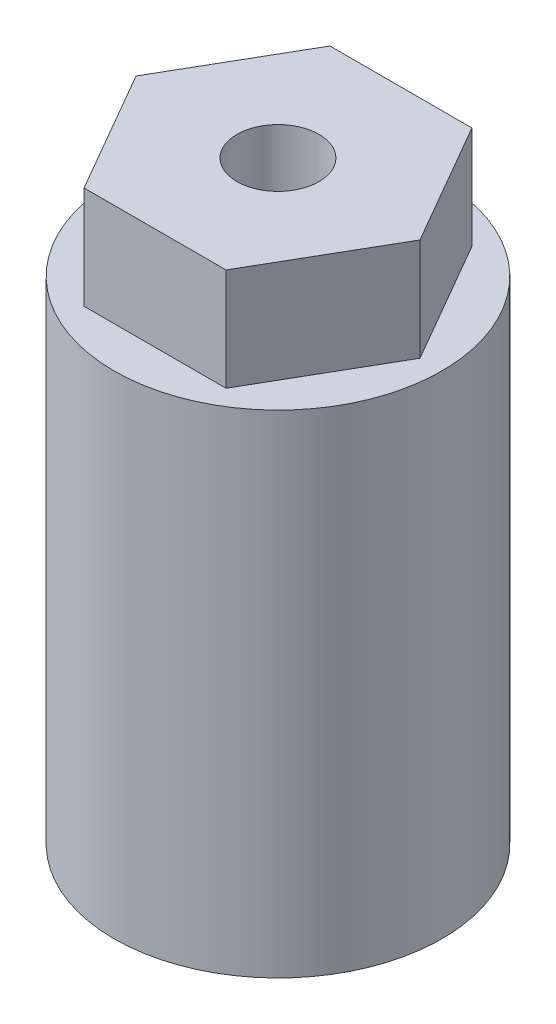
ISO-10303-21;
HEADER;
FILE_DESCRIPTION(('STEP AP214'),'2;1');
FILE_NAME('part.step','',(''),(''),'','','');
FILE_SCHEMA(('AUTOMOTIVE_DESIGN { 1 0 10303 214 1 1 1 1 }'));
ENDSEC;
DATA;
#1=APPLICATION_CONTEXT('core data for automotive mechanical design processes');
#2=APPLICATION_PROTOCOL_DEFINITION('international standard','automotive_design',2000,#1);
#3=PRODUCT_CONTEXT('',#1,'mechanical');
#4=PRODUCT('Part','Part','',(#3));
#5=PRODUCT_RELATED_PRODUCT_CATEGORY('part','',(#4));
#6=PRODUCT_DEFINITION_FORMATION('','',#4);
#7=PRODUCT_DEFINITION_CONTEXT('part definition',#1,'design');
#8=PRODUCT_DEFINITION('design','',#6,#7);
#9=PRODUCT_DEFINITION_SHAPE('','',#8);
#10=(LENGTH_UNIT() NAMED_UNIT(*) SI_UNIT(.MILLI.,.METRE.));
#11=(NAMED_UNIT(*) PLANE_ANGLE_UNIT() SI_UNIT($,.RADIAN.));
#12=(NAMED_UNIT(*) SI_UNIT($,.STERADIAN.) SOLID_ANGLE_UNIT());
#13=UNCERTAINTY_MEASURE_WITH_UNIT(LENGTH_MEASURE(1.E-05),#10,'distance_accuracy_value','');
#14=(GEOMETRIC_REPRESENTATION_CONTEXT(3) GLOBAL_UNCERTAINTY_ASSIGNED_CONTEXT((#13)) GLOBAL_UNIT_ASSIGNED_CONTEXT((#10,
#11,#12)) REPRESENTATION_CONTEXT('',''));
#15=CARTESIAN_POINT('',(0.,0.,0.));
#16=DIRECTION('',(0.,0.,1.));
#17=DIRECTION('',(1.,0.,0.));
#18=AXIS2_PLACEMENT_3D('',#15,#16,#17);
#19=CARTESIAN_POINT('',(0.,0.,0.));
#20=DIRECTION('',(0.,-1.,0.));
#21=DIRECTION('',(0.,0.,-1.));
#22=AXIS2_PLACEMENT_3D('',#19,#20,#21);
#23=CYLINDRICAL_SURFACE('',#22,4.);
#24=CARTESIAN_POINT('',(0.,0.,0.));
#25=DIRECTION('',(0.,-1.,0.));
#26=DIRECTION('',(0.,0.,-1.));
#27=AXIS2_PLACEMENT_3D('',#24,#25,#26);
#28=CIRCLE('',#27,4.);
#29=CARTESIAN_POINT('',(3.70809924354783,0.,1.5));
#30=VERTEX_POINT('',#29);
#31=CARTESIAN_POINT('',(3.70809924354783,0.,-1.5));
#32=VERTEX_POINT('',#31);
#33=EDGE_CURVE('E11',#30,#32,#28,.T.);
#34=ORIENTED_EDGE('',*,*,#33,.T.);
#35=DIRECTION('',(0.,-1.,0.));
#36=VECTOR('',#35,1.);
#37=CARTESIAN_POINT('',(3.70809924354783,0.,-1.5));
#38=LINE('',#37,#36);
#39=CARTESIAN_POINT('',(3.70809924354783,12.,-1.5));
#40=VERTEX_POINT('',#39);
#41=EDGE_CURVE('E121',#32,#40,#38,.F.);
#42=ORIENTED_EDGE('',*,*,#41,.T.);
#43=CARTESIAN_POINT('',(0.,12.,0.));
#44=DIRECTION('',(0.,-1.,0.));
#45=DIRECTION('',(0.,0.,-1.));
#46=AXIS2_PLACEMENT_3D('',#43,#44,#45);
#47=CIRCLE('',#46,4.);
#48=CARTESIAN_POINT('',(3.70809924354783,12.,1.5));
#49=VERTEX_POINT('',#48);
#50=EDGE_CURVE('E200',#49,#40,#47,.T.);
#51=ORIENTED_EDGE('',*,*,#50,.F.);
#52=DIRECTION('',(0.,-1.,0.));
#53=VECTOR('',#52,1.);
#54=CARTESIAN_POINT('',(3.70809924354783,0.,1.5));
#55=LINE('',#54,#53);
#56=EDGE_CURVE('E144',#49,#30,#55,.T.);
#57=ORIENTED_EDGE('',*,*,#56,.T.);
#58=EDGE_LOOP('',(#34,#42,#51,#57));
#59=FACE_BOUND('',#58,.T.);
#60=ADVANCED_FACE('F36',(#59),#23,.F.);
#61=CARTESIAN_POINT('',(0.,0.,0.));
#62=DIRECTION('',(0.,-1.,0.));
#63=DIRECTION('',(0.,0.,-1.));
#64=AXIS2_PLACEMENT_3D('',#61,#62,#63);
#65=PLANE('',#64);
#66=DIRECTION('',(1.,0.,0.));
#67=VECTOR('',#66,1.);
#68=CARTESIAN_POINT('',(2.5,0.,-1.5));
#69=LINE('',#68,#67);
#70=CARTESIAN_POINT('',(5.5,0.,-1.5));
#71=VERTEX_POINT('',#70);
#72=EDGE_CURVE('E117',#32,#71,#69,.T.);
#73=ORIENTED_EDGE('',*,*,#72,.F.);
#74=ORIENTED_EDGE('',*,*,#33,.F.);
#75=DIRECTION('',(-1.,0.,0.));
#76=VECTOR('',#75,1.);
#77=CARTESIAN_POINT('',(2.5,0.,1.5));
#78=LINE('',#77,#76);
#79=CARTESIAN_POINT('',(5.5,0.,1.5));
#80=VERTEX_POINT('',#79);
#81=EDGE_CURVE('E125',#80,#30,#78,.T.);
#82=ORIENTED_EDGE('',*,*,#81,.F.);
#83=DIRECTION('',(0.,0.,1.));
#84=VECTOR('',#83,1.);
#85=CARTESIAN_POINT('',(5.5,0.,-1.5));
#86=LINE('',#85,#84);
#87=EDGE_CURVE('E50',#71,#80,#86,.T.);
#88=ORIENTED_EDGE('',*,*,#87,.F.);
#89=EDGE_LOOP('',(#73,#74,#82,#88));
#90=FACE_BOUND('',#89,.T.);
#91=CARTESIAN_POINT('',(0.,0.,0.));
#92=DIRECTION('',(0.,-1.,0.));
#93=DIRECTION('',(0.,0.,-1.));
#94=AXIS2_PLACEMENT_3D('',#91,#92,#93);
#95=CIRCLE('',#94,8.);
#96=CARTESIAN_POINT('',(0.,0.,-8.));
#97=VERTEX_POINT('',#96);
#98=EDGE_CURVE('E43',#97,#97,#95,.T.);
#99=ORIENTED_EDGE('',*,*,#98,.T.);
#100=EDGE_LOOP('',(#99));
#101=FACE_BOUND('',#100,.T.);
#102=ADVANCED_FACE('F134',(#90,#101),#65,.T.);
#103=CARTESIAN_POINT('',(0.,0.,0.));
#104=DIRECTION('',(0.,-1.,0.));
#105=DIRECTION('',(0.,0.,-1.));
#106=AXIS2_PLACEMENT_3D('',#103,#104,#105);
#107=CYLINDRICAL_SURFACE('',#106,8.);
#108=CARTESIAN_POINT('',(0.,24.,0.));
#109=DIRECTION('',(0.,-1.,0.));
#110=DIRECTION('',(0.,0.,-1.));
#111=AXIS2_PLACEMENT_3D('',#108,#109,#110);
#112=CIRCLE('',#111,8.);
#113=CARTESIAN_POINT('',(0.,24.,-8.));
#114=VERTEX_POINT('',#113);
#115=EDGE_CURVE('E203',#114,#114,#112,.T.);
#116=ORIENTED_EDGE('',*,*,#115,.T.);
#117=EDGE_LOOP('',(#116));
#118=FACE_BOUND('',#117,.T.);
#119=ORIENTED_EDGE('',*,*,#98,.F.);
#120=EDGE_LOOP('',(#119));
#121=FACE_BOUND('',#120,.T.);
#122=ADVANCED_FACE('F208',(#118,#121),#107,.T.);
#123=CARTESIAN_POINT('',(0.,24.,0.));
#124=DIRECTION('',(0.,1.,0.));
#125=DIRECTION('',(0.,0.,1.));
#126=AXIS2_PLACEMENT_3D('',#123,#124,#125);
#127=PLANE('',#126);
#128=DIRECTION('',(0.5,0.,-0.866025403784439));
#129=VECTOR('',#128,1.);
#130=CARTESIAN_POINT('',(3.46410161513775,24.,6.));
#131=LINE('',#130,#129);
#132=CARTESIAN_POINT('',(3.46410161513775,24.,6.));
#133=VERTEX_POINT('',#132);
#134=CARTESIAN_POINT('',(6.92820323027551,24.,0.));
#135=VERTEX_POINT('',#134);
#136=EDGE_CURVE('E58',#133,#135,#131,.T.);
#137=ORIENTED_EDGE('',*,*,#136,.F.);
#138=DIRECTION('',(1.,0.,0.));
#139=VECTOR('',#138,1.);
#140=CARTESIAN_POINT('',(-3.46410161513775,24.,6.));
#141=LINE('',#140,#139);
#142=CARTESIAN_POINT('',(-3.46410161513775,24.,6.));
#143=VERTEX_POINT('',#142);
#144=EDGE_CURVE('E158',#143,#133,#141,.T.);
#145=ORIENTED_EDGE('',*,*,#144,.F.);
#146=DIRECTION('',(0.5,0.,0.866025403784439));
#147=VECTOR('',#146,1.);
#148=CARTESIAN_POINT('',(-6.92820323027551,24.,0.));
#149=LINE('',#148,#147);
#150=CARTESIAN_POINT('',(-6.92820323027551,24.,0.));
#151=VERTEX_POINT('',#150);
#152=EDGE_CURVE('E179',#151,#143,#149,.T.);
#153=ORIENTED_EDGE('',*,*,#152,.F.);
#154=DIRECTION('',(-0.5,0.,0.866025403784439));
#155=VECTOR('',#154,1.);
#156=CARTESIAN_POINT('',(-3.46410161513775,24.,-6.));
#157=LINE('',#156,#155);
#158=CARTESIAN_POINT('',(-3.46410161513775,24.,-6.));
#159=VERTEX_POINT('',#158);
#160=EDGE_CURVE('E176',#159,#151,#157,.T.);
#161=ORIENTED_EDGE('',*,*,#160,.F.);
#162=DIRECTION('',(-1.,0.,0.));
#163=VECTOR('',#162,1.);
#164=CARTESIAN_POINT('',(3.46410161513775,24.,-6.));
#165=LINE('',#164,#163);
#166=CARTESIAN_POINT('',(3.46410161513775,24.,-6.));
#167=VERTEX_POINT('',#166);
#168=EDGE_CURVE('E173',#167,#159,#165,.T.);
#169=ORIENTED_EDGE('',*,*,#168,.F.);
#170=DIRECTION('',(-0.5,0.,-0.866025403784439));
#171=VECTOR('',#170,1.);
#172=CARTESIAN_POINT('',(6.92820323027551,24.,0.));
#173=LINE('',#172,#171);
#174=EDGE_CURVE('E170',#135,#167,#173,.T.);
#175=ORIENTED_EDGE('',*,*,#174,.F.);
#176=EDGE_LOOP('',(#137,#145,#153,#161,#169,#175));
#177=FACE_BOUND('',#176,.T.);
#178=ORIENTED_EDGE('',*,*,#115,.F.);
#179=EDGE_LOOP('',(#178));
#180=FACE_BOUND('',#179,.T.);
#181=ADVANCED_FACE('F210',(#177,#180),#127,.T.);
#182=CARTESIAN_POINT('',(0.,12.,0.));
#183=DIRECTION('',(0.,-1.,0.));
#184=DIRECTION('',(0.,0.,-1.));
#185=AXIS2_PLACEMENT_3D('',#182,#183,#184);
#186=PLANE('',#185);
#187=ORIENTED_EDGE('',*,*,#50,.T.);
#188=DIRECTION('',(-1.,0.,0.));
#189=VECTOR('',#188,1.);
#190=CARTESIAN_POINT('',(2.5,12.,-1.5));
#191=LINE('',#190,#189);
#192=CARTESIAN_POINT('',(5.5,12.,-1.5));
#193=VERTEX_POINT('',#192);
#194=EDGE_CURVE('E131',#193,#40,#191,.T.);
#195=ORIENTED_EDGE('',*,*,#194,.F.);
#196=DIRECTION('',(0.,0.,-1.));
#197=VECTOR('',#196,1.);
#198=CARTESIAN_POINT('',(5.5,12.,-1.5));
#199=LINE('',#198,#197);
#200=CARTESIAN_POINT('',(5.5,12.,1.5));
#201=VERTEX_POINT('',#200);
#202=EDGE_CURVE('E129',#201,#193,#199,.T.);
#203=ORIENTED_EDGE('',*,*,#202,.F.);
#204=DIRECTION('',(1.,0.,0.));
#205=VECTOR('',#204,1.);
#206=CARTESIAN_POINT('',(2.5,12.,1.5));
#207=LINE('',#206,#205);
#208=EDGE_CURVE('E142',#49,#201,#207,.T.);
#209=ORIENTED_EDGE('',*,*,#208,.F.);
#210=EDGE_LOOP('',(#187,#195,#203,#209));
#211=FACE_BOUND('',#210,.T.);
#212=ADVANCED_FACE('F217',(#211),#186,.T.);
#213=CARTESIAN_POINT('',(3.46410161513775,29.,6.));
#214=DIRECTION('',(-0.866025403784439,0.,-0.5));
#215=DIRECTION('',(-0.5,0.,0.866025403784439));
#216=AXIS2_PLACEMENT_3D('',#213,#214,#215);
#217=PLANE('',#216);
#218=ORIENTED_EDGE('',*,*,#136,.T.);
#219=DIRECTION('',(0.,-1.,0.));
#220=VECTOR('',#219,1.);
#221=CARTESIAN_POINT('',(6.92820323027551,29.,0.));
#222=LINE('',#221,#220);
#223=CARTESIAN_POINT('',(6.92820323027551,29.,0.));
#224=VERTEX_POINT('',#223);
#225=EDGE_CURVE('E197',#224,#135,#222,.T.);
#226=ORIENTED_EDGE('',*,*,#225,.F.);
#227=DIRECTION('',(0.5,0.,-0.866025403784439));
#228=VECTOR('',#227,1.);
#229=CARTESIAN_POINT('',(3.46410161513775,29.,6.));
#230=LINE('',#229,#228);
#231=CARTESIAN_POINT('',(3.46410161513775,29.,6.));
#232=VERTEX_POINT('',#231);
#233=EDGE_CURVE('E154',#232,#224,#230,.T.);
#234=ORIENTED_EDGE('',*,*,#233,.F.);
#235=DIRECTION('',(0.,-1.,0.));
#236=VECTOR('',#235,1.);
#237=CARTESIAN_POINT('',(3.46410161513775,29.,6.));
#238=LINE('',#237,#236);
#239=EDGE_CURVE('E168',#232,#133,#238,.T.);
#240=ORIENTED_EDGE('',*,*,#239,.T.);
#241=EDGE_LOOP('',(#218,#226,#234,#240));
#242=FACE_BOUND('',#241,.T.);
#243=ADVANCED_FACE('F229',(#242),#217,.F.);
#244=CARTESIAN_POINT('',(6.92820323027551,29.,0.));
#245=DIRECTION('',(-0.866025403784439,0.,0.5));
#246=DIRECTION('',(0.5,0.,0.866025403784439));
#247=AXIS2_PLACEMENT_3D('',#244,#245,#246);
#248=PLANE('',#247);
#249=ORIENTED_EDGE('',*,*,#174,.T.);
#250=DIRECTION('',(0.,-1.,0.));
#251=VECTOR('',#250,1.);
#252=CARTESIAN_POINT('',(3.46410161513775,29.,-6.));
#253=LINE('',#252,#251);
#254=CARTESIAN_POINT('',(3.46410161513775,29.,-6.));
#255=VERTEX_POINT('',#254);
#256=EDGE_CURVE('E194',#255,#167,#253,.T.);
#257=ORIENTED_EDGE('',*,*,#256,.F.);
#258=DIRECTION('',(-0.5,0.,-0.866025403784439));
#259=VECTOR('',#258,1.);
#260=CARTESIAN_POINT('',(6.92820323027551,29.,0.));
#261=LINE('',#260,#259);
#262=EDGE_CURVE('E157',#224,#255,#261,.T.);
#263=ORIENTED_EDGE('',*,*,#262,.F.);
#264=ORIENTED_EDGE('',*,*,#225,.T.);
#265=EDGE_LOOP('',(#249,#257,#263,#264));
#266=FACE_BOUND('',#265,.T.);
#267=ADVANCED_FACE('F234',(#266),#248,.F.);
#268=CARTESIAN_POINT('',(3.46410161513775,29.,-6.));
#269=DIRECTION('',(0.,0.,1.));
#270=DIRECTION('',(1.,0.,0.));
#271=AXIS2_PLACEMENT_3D('',#268,#269,#270);
#272=PLANE('',#271);
#273=ORIENTED_EDGE('',*,*,#168,.T.);
#274=DIRECTION('',(0.,-1.,0.));
#275=VECTOR('',#274,1.);
#276=CARTESIAN_POINT('',(-3.46410161513775,29.,-6.));
#277=LINE('',#276,#275);
#278=CARTESIAN_POINT('',(-3.46410161513775,29.,-6.));
#279=VERTEX_POINT('',#278);
#280=EDGE_CURVE('E191',#279,#159,#277,.T.);
#281=ORIENTED_EDGE('',*,*,#280,.F.);
#282=DIRECTION('',(-1.,0.,0.));
#283=VECTOR('',#282,1.);
#284=CARTESIAN_POINT('',(3.46410161513775,29.,-6.));
#285=LINE('',#284,#283);
#286=EDGE_CURVE('E160',#255,#279,#285,.T.);
#287=ORIENTED_EDGE('',*,*,#286,.F.);
#288=ORIENTED_EDGE('',*,*,#256,.T.);
#289=EDGE_LOOP('',(#273,#281,#287,#288));
#290=FACE_BOUND('',#289,.T.);
#291=ADVANCED_FACE('F240',(#290),#272,.F.);
#292=CARTESIAN_POINT('',(-3.46410161513775,29.,-6.));
#293=DIRECTION('',(0.866025403784439,0.,0.5));
#294=DIRECTION('',(0.5,0.,-0.866025403784439));
#295=AXIS2_PLACEMENT_3D('',#292,#293,#294);
#296=PLANE('',#295);
#297=ORIENTED_EDGE('',*,*,#160,.T.);
#298=DIRECTION('',(0.,-1.,0.));
#299=VECTOR('',#298,1.);
#300=CARTESIAN_POINT('',(-6.92820323027551,29.,0.));
#301=LINE('',#300,#299);
#302=CARTESIAN_POINT('',(-6.92820323027551,29.,0.));
#303=VERTEX_POINT('',#302);
#304=EDGE_CURVE('E188',#303,#151,#301,.T.);
#305=ORIENTED_EDGE('',*,*,#304,.F.);
#306=DIRECTION('',(-0.5,0.,0.866025403784439));
#307=VECTOR('',#306,1.);
#308=CARTESIAN_POINT('',(-3.46410161513775,29.,-6.));
#309=LINE('',#308,#307);
#310=EDGE_CURVE('E162',#279,#303,#309,.T.);
#311=ORIENTED_EDGE('',*,*,#310,.F.);
#312=ORIENTED_EDGE('',*,*,#280,.T.);
#313=EDGE_LOOP('',(#297,#305,#311,#312));
#314=FACE_BOUND('',#313,.T.);
#315=ADVANCED_FACE('F244',(#314),#296,.F.);
#316=CARTESIAN_POINT('',(-6.92820323027551,29.,0.));
#317=DIRECTION('',(0.866025403784439,0.,-0.5));
#318=DIRECTION('',(-0.5,0.,-0.866025403784439));
#319=AXIS2_PLACEMENT_3D('',#316,#317,#318);
#320=PLANE('',#319);
#321=ORIENTED_EDGE('',*,*,#152,.T.);
#322=DIRECTION('',(0.,-1.,0.));
#323=VECTOR('',#322,1.);
#324=CARTESIAN_POINT('',(-3.46410161513775,29.,6.));
#325=LINE('',#324,#323);
#326=CARTESIAN_POINT('',(-3.46410161513775,29.,6.));
#327=VERTEX_POINT('',#326);
#328=EDGE_CURVE('E185',#327,#143,#325,.T.);
#329=ORIENTED_EDGE('',*,*,#328,.F.);
#330=DIRECTION('',(0.5,0.,0.866025403784439));
#331=VECTOR('',#330,1.);
#332=CARTESIAN_POINT('',(-6.92820323027551,29.,0.));
#333=LINE('',#332,#331);
#334=EDGE_CURVE('E164',#303,#327,#333,.T.);
#335=ORIENTED_EDGE('',*,*,#334,.F.);
#336=ORIENTED_EDGE('',*,*,#304,.T.);
#337=EDGE_LOOP('',(#321,#329,#335,#336));
#338=FACE_BOUND('',#337,.T.);
#339=ADVANCED_FACE('F248',(#338),#320,.F.);
#340=CARTESIAN_POINT('',(-3.46410161513775,29.,6.));
#341=DIRECTION('',(0.,0.,-1.));
#342=DIRECTION('',(-1.,0.,0.));
#343=AXIS2_PLACEMENT_3D('',#340,#341,#342);
#344=PLANE('',#343);
#345=ORIENTED_EDGE('',*,*,#144,.T.);
#346=ORIENTED_EDGE('',*,*,#239,.F.);
#347=DIRECTION('',(1.,0.,0.));
#348=VECTOR('',#347,1.);
#349=CARTESIAN_POINT('',(-3.46410161513775,29.,6.));
#350=LINE('',#349,#348);
#351=EDGE_CURVE('E166',#327,#232,#350,.T.);
#352=ORIENTED_EDGE('',*,*,#351,.F.);
#353=ORIENTED_EDGE('',*,*,#328,.T.);
#354=EDGE_LOOP('',(#345,#346,#352,#353));
#355=FACE_BOUND('',#354,.T.);
#356=ADVANCED_FACE('F252',(#355),#344,.F.);
#357=CARTESIAN_POINT('',(0.,29.,0.));
#358=DIRECTION('',(0.,1.,0.));
#359=DIRECTION('',(0.,0.,1.));
#360=AXIS2_PLACEMENT_3D('',#357,#358,#359);
#361=PLANE('',#360);
#362=CARTESIAN_POINT('',(0.,29.,0.));
#363=DIRECTION('',(0.,1.,0.));
#364=DIRECTION('',(0.,0.,1.));
#365=AXIS2_PLACEMENT_3D('',#362,#363,#364);
#366=CIRCLE('',#365,2.);
#367=CARTESIAN_POINT('',(0.,29.,2.));
#368=VERTEX_POINT('',#367);
#369=EDGE_CURVE('E148',#368,#368,#366,.T.);
#370=ORIENTED_EDGE('',*,*,#369,.F.);
#371=EDGE_LOOP('',(#370));
#372=FACE_BOUND('',#371,.T.);
#373=ORIENTED_EDGE('',*,*,#233,.T.);
#374=ORIENTED_EDGE('',*,*,#262,.T.);
#375=ORIENTED_EDGE('',*,*,#286,.T.);
#376=ORIENTED_EDGE('',*,*,#310,.T.);
#377=ORIENTED_EDGE('',*,*,#334,.T.);
#378=ORIENTED_EDGE('',*,*,#351,.T.);
#379=EDGE_LOOP('',(#373,#374,#375,#376,#377,#378));
#380=FACE_BOUND('',#379,.T.);
#381=ADVANCED_FACE('F256',(#372,#380),#361,.T.);
#382=CARTESIAN_POINT('',(0.,19.,0.));
#383=DIRECTION('',(0.,1.,0.));
#384=DIRECTION('',(0.,0.,1.));
#385=AXIS2_PLACEMENT_3D('',#382,#383,#384);
#386=CONICAL_SURFACE('',#385,2.,1.02974425867665);
#387=CARTESIAN_POINT('',(0.,17.7982787619449,0.));
#388=VERTEX_POINT('',#387);
#389=VERTEX_LOOP('',#388);
#390=FACE_BOUND('',#389,.T.);
#391=CARTESIAN_POINT('',(0.,19.,0.));
#392=DIRECTION('',(0.,1.,0.));
#393=DIRECTION('',(0.,0.,1.));
#394=AXIS2_PLACEMENT_3D('',#391,#392,#393);
#395=CIRCLE('',#394,2.);
#396=CARTESIAN_POINT('',(0.,19.,2.));
#397=VERTEX_POINT('',#396);
#398=EDGE_CURVE('E151',#397,#397,#395,.T.);
#399=ORIENTED_EDGE('',*,*,#398,.T.);
#400=EDGE_LOOP('',(#399));
#401=FACE_BOUND('',#400,.T.);
#402=ADVANCED_FACE('F260',(#390,#401),#386,.F.);
#403=CARTESIAN_POINT('',(0.,29.,0.));
#404=DIRECTION('',(0.,1.,0.));
#405=DIRECTION('',(0.,0.,1.));
#406=AXIS2_PLACEMENT_3D('',#403,#404,#405);
#407=CYLINDRICAL_SURFACE('',#406,2.);
#408=ORIENTED_EDGE('',*,*,#398,.F.);
#409=EDGE_LOOP('',(#408));
#410=FACE_BOUND('',#409,.T.);
#411=ORIENTED_EDGE('',*,*,#369,.T.);
#412=EDGE_LOOP('',(#411));
#413=FACE_BOUND('',#412,.T.);
#414=ADVANCED_FACE('F264',(#410,#413),#407,.F.);
#415=CARTESIAN_POINT('',(2.5,16.2426406871193,-1.5));
#416=DIRECTION('',(0.,0.,-1.));
#417=DIRECTION('',(-1.,0.,0.));
#418=AXIS2_PLACEMENT_3D('',#415,#416,#417);
#419=PLANE('',#418);
#420=ORIENTED_EDGE('',*,*,#72,.T.);
#421=DIRECTION('',(0.,-1.,0.));
#422=VECTOR('',#421,1.);
#423=CARTESIAN_POINT('',(5.5,16.2426406871193,-1.5));
#424=LINE('',#423,#422);
#425=EDGE_CURVE('E119',#193,#71,#424,.T.);
#426=ORIENTED_EDGE('',*,*,#425,.F.);
#427=ORIENTED_EDGE('',*,*,#194,.T.);
#428=ORIENTED_EDGE('',*,*,#41,.F.);
#429=EDGE_LOOP('',(#420,#426,#427,#428));
#430=FACE_BOUND('',#429,.T.);
#431=ADVANCED_FACE('F118',(#430),#419,.F.);
#432=CARTESIAN_POINT('',(2.5,16.2426406871193,1.5));
#433=DIRECTION('',(0.,0.,1.));
#434=DIRECTION('',(1.,0.,0.));
#435=AXIS2_PLACEMENT_3D('',#432,#433,#434);
#436=PLANE('',#435);
#437=ORIENTED_EDGE('',*,*,#208,.T.);
#438=DIRECTION('',(0.,-1.,0.));
#439=VECTOR('',#438,1.);
#440=CARTESIAN_POINT('',(5.5,16.2426406871193,1.5));
#441=LINE('',#440,#439);
#442=EDGE_CURVE('E124',#201,#80,#441,.T.);
#443=ORIENTED_EDGE('',*,*,#442,.T.);
#444=ORIENTED_EDGE('',*,*,#81,.T.);
#445=ORIENTED_EDGE('',*,*,#56,.F.);
#446=EDGE_LOOP('',(#437,#443,#444,#445));
#447=FACE_BOUND('',#446,.T.);
#448=ADVANCED_FACE('F226',(#447),#436,.F.);
#449=CARTESIAN_POINT('',(5.5,16.2426406871193,-1.5));
#450=DIRECTION('',(1.,0.,0.));
#451=DIRECTION('',(0.,0.,-1.));
#452=AXIS2_PLACEMENT_3D('',#449,#450,#451);
#453=PLANE('',#452);
#454=ORIENTED_EDGE('',*,*,#202,.T.);
#455=ORIENTED_EDGE('',*,*,#425,.T.);
#456=ORIENTED_EDGE('',*,*,#87,.T.);
#457=ORIENTED_EDGE('',*,*,#442,.F.);
#458=EDGE_LOOP('',(#454,#455,#456,#457));
#459=FACE_BOUND('',#458,.T.);
#460=ADVANCED_FACE('F127',(#459),#453,.F.);
#461=CLOSED_SHELL('',(#60,#102,#122,#181,#212,#243,#267,#291,#315,#339,#356,#381,#402,#414,#431,
#448,#460));
#462=MANIFOLD_SOLID_BREP('B2',#461);
#463=ADVANCED_BREP_SHAPE_REPRESENTATION('',(#18,#462),#14);
#464=SHAPE_DEFINITION_REPRESENTATION(#9,#463);
ENDSEC;
END-ISO-10303-21;
